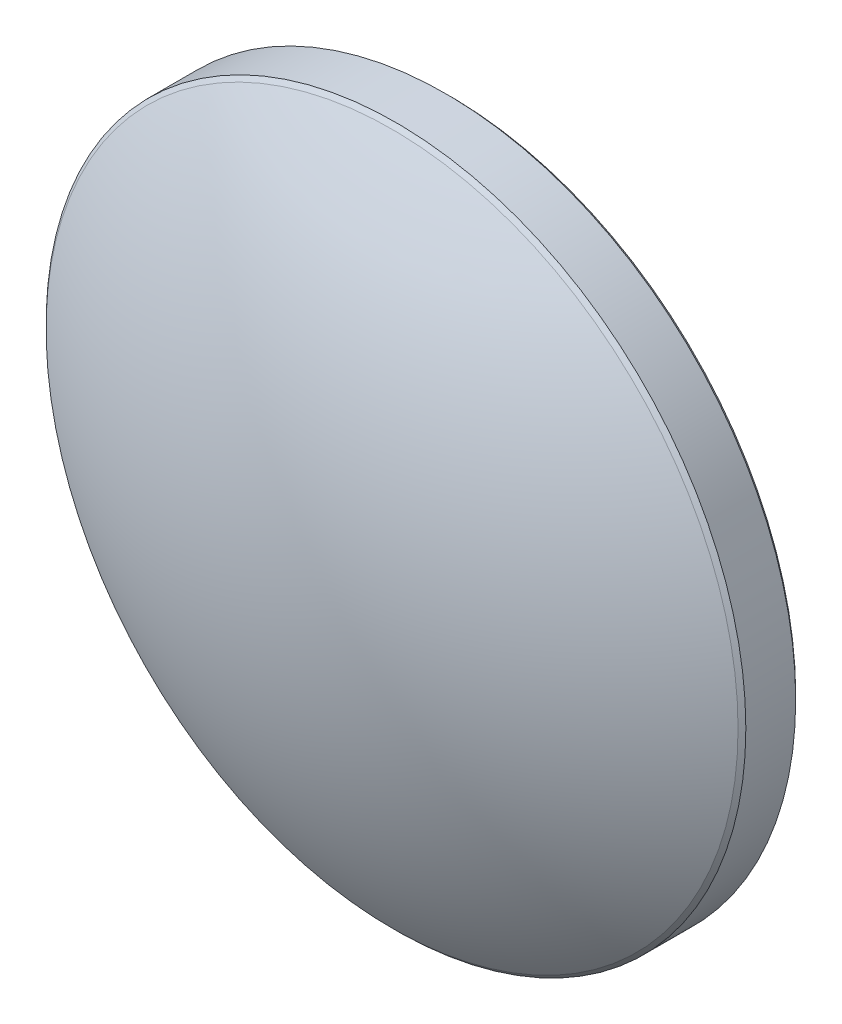
ISO-10303-21;
HEADER;
FILE_DESCRIPTION(('STEP AP214'),'2;1');
FILE_NAME('part.step','',(''),(''),'','','');
FILE_SCHEMA(('AUTOMOTIVE_DESIGN { 1 0 10303 214 1 1 1 1 }'));
ENDSEC;
DATA;
#1=APPLICATION_CONTEXT('core data for automotive mechanical design processes');
#2=APPLICATION_PROTOCOL_DEFINITION('international standard','automotive_design',2000,#1);
#3=PRODUCT_CONTEXT('',#1,'mechanical');
#4=PRODUCT('Part','Part','',(#3));
#5=PRODUCT_RELATED_PRODUCT_CATEGORY('part','',(#4));
#6=PRODUCT_DEFINITION_FORMATION('','',#4);
#7=PRODUCT_DEFINITION_CONTEXT('part definition',#1,'design');
#8=PRODUCT_DEFINITION('design','',#6,#7);
#9=PRODUCT_DEFINITION_SHAPE('','',#8);
#10=(LENGTH_UNIT() NAMED_UNIT(*) SI_UNIT(.MILLI.,.METRE.));
#11=(NAMED_UNIT(*) PLANE_ANGLE_UNIT() SI_UNIT($,.RADIAN.));
#12=(NAMED_UNIT(*) SI_UNIT($,.STERADIAN.) SOLID_ANGLE_UNIT());
#13=UNCERTAINTY_MEASURE_WITH_UNIT(LENGTH_MEASURE(1.E-05),#10,'distance_accuracy_value','');
#14=(GEOMETRIC_REPRESENTATION_CONTEXT(3) GLOBAL_UNCERTAINTY_ASSIGNED_CONTEXT((#13)) GLOBAL_UNIT_ASSIGNED_CONTEXT((#10,
#11,#12)) REPRESENTATION_CONTEXT('',''));
#15=CARTESIAN_POINT('',(0.,0.,0.));
#16=DIRECTION('',(0.,0.,1.));
#17=DIRECTION('',(1.,0.,0.));
#18=AXIS2_PLACEMENT_3D('',#15,#16,#17);
#19=CARTESIAN_POINT('',(0.00639396811435555,0.,-20.0899991112428));
#20=DIRECTION('',(0.,-1.,0.));
#21=DIRECTION('',(1.,0.,0.));
#22=AXIS2_PLACEMENT_3D('',#19,#20,#21);
#23=CIRCLE('',#22,23.);
#24=TRIMMED_CURVE('',#23,(PARAMETER_VALUE(-1.57107432541215)),
(PARAMETER_VALUE(1.57107432541215)),.T.,.PARAMETER.);
#25=CARTESIAN_POINT('',(0.,0.,-20.0899991112428));
#26=DIRECTION('',(0.,0.,1.));
#27=AXIS1_PLACEMENT('',#25,#26);
#28=SURFACE_OF_REVOLUTION('',#24,#27);
#29=CARTESIAN_POINT('',(0.,0.,2.91));
#30=VERTEX_POINT('',#29);
#31=VERTEX_LOOP('',#30);
#32=FACE_BOUND('',#31,.T.);
#33=CARTESIAN_POINT('',(0.,0.,-0.817151374895762));
#34=DIRECTION('',(0.,0.,1.));
#35=DIRECTION('',(1.,0.,0.));
#36=AXIS2_PLACEMENT_3D('',#33,#34,#35);
#37=CIRCLE('',#36,12.5585786437627);
#38=CARTESIAN_POINT('',(12.5585786437627,0.,-0.817151374895762));
#39=VERTEX_POINT('',#38);
#40=EDGE_CURVE('E29',#39,#39,#37,.T.);
#41=ORIENTED_EDGE('',*,*,#40,.T.);
#42=EDGE_LOOP('',(#41));
#43=FACE_BOUND('',#42,.T.);
#44=ADVANCED_FACE('F15',(#32,#43),#28,.T.);
#45=CARTESIAN_POINT('',(0.,0.,-2.91));
#46=DIRECTION('',(0.,0.,1.));
#47=DIRECTION('',(1.,0.,0.));
#48=AXIS2_PLACEMENT_3D('',#45,#46,#47);
#49=PLANE('',#48);
#50=CARTESIAN_POINT('',(0.,0.,-2.91));
#51=DIRECTION('',(0.,0.,1.));
#52=DIRECTION('',(1.,0.,0.));
#53=AXIS2_PLACEMENT_3D('',#50,#51,#52);
#54=CIRCLE('',#53,12.5585786437627);
#55=CARTESIAN_POINT('',(12.5585786437627,0.,-2.91));
#56=VERTEX_POINT('',#55);
#57=EDGE_CURVE('E10',#56,#56,#54,.T.);
#58=ORIENTED_EDGE('',*,*,#57,.F.);
#59=EDGE_LOOP('',(#58));
#60=FACE_BOUND('',#59,.T.);
#61=ADVANCED_FACE('F26',(#60),#49,.F.);
#62=CARTESIAN_POINT('',(0.,0.,-2.91));
#63=DIRECTION('',(0.,0.,1.));
#64=DIRECTION('',(1.,0.,0.));
#65=AXIS2_PLACEMENT_3D('',#62,#63,#64);
#66=CONICAL_SURFACE('',#65,12.5585786437627,0.785398163397436);
#67=CARTESIAN_POINT('',(0.,0.,-2.76857864376269));
#68=DIRECTION('',(0.,0.,1.));
#69=DIRECTION('',(1.,0.,0.));
#70=AXIS2_PLACEMENT_3D('',#67,#68,#69);
#71=CIRCLE('',#70,12.7);
#72=CARTESIAN_POINT('',(12.7,0.,-2.76857864376269));
#73=VERTEX_POINT('',#72);
#74=EDGE_CURVE('E21',#73,#73,#71,.T.);
#75=ORIENTED_EDGE('',*,*,#74,.F.);
#76=EDGE_LOOP('',(#75));
#77=FACE_BOUND('',#76,.T.);
#78=ORIENTED_EDGE('',*,*,#57,.T.);
#79=EDGE_LOOP('',(#78));
#80=FACE_BOUND('',#79,.T.);
#81=ADVANCED_FACE('F40',(#77,#80),#66,.T.);
#82=CARTESIAN_POINT('',(0.,0.,35.9400018251086));
#83=DIRECTION('',(0.,0.,1.));
#84=DIRECTION('',(1.,0.,0.));
#85=AXIS2_PLACEMENT_3D('',#82,#83,#84);
#86=CYLINDRICAL_SURFACE('',#85,12.7);
#87=CARTESIAN_POINT('',(0.,0.,-0.958572731133069));
#88=DIRECTION('',(0.,0.,1.));
#89=DIRECTION('',(1.,0.,0.));
#90=AXIS2_PLACEMENT_3D('',#87,#88,#89);
#91=CIRCLE('',#90,12.7);
#92=CARTESIAN_POINT('',(12.7,0.,-0.958572731133069));
#93=VERTEX_POINT('',#92);
#94=EDGE_CURVE('E31',#93,#93,#91,.T.);
#95=ORIENTED_EDGE('',*,*,#94,.F.);
#96=EDGE_LOOP('',(#95));
#97=FACE_BOUND('',#96,.T.);
#98=ORIENTED_EDGE('',*,*,#74,.T.);
#99=EDGE_LOOP('',(#98));
#100=FACE_BOUND('',#99,.T.);
#101=ADVANCED_FACE('F38',(#97,#100),#86,.T.);
#102=CARTESIAN_POINT('',(0.,0.,-0.958572731133069));
#103=DIRECTION('',(0.,0.,-1.));
#104=DIRECTION('',(-1.,0.,0.));
#105=AXIS2_PLACEMENT_3D('',#102,#103,#104);
#106=CONICAL_SURFACE('',#105,12.7,0.785398163397454);
#107=ORIENTED_EDGE('',*,*,#40,.F.);
#108=EDGE_LOOP('',(#107));
#109=FACE_BOUND('',#108,.T.);
#110=ORIENTED_EDGE('',*,*,#94,.T.);
#111=EDGE_LOOP('',(#110));
#112=FACE_BOUND('',#111,.T.);
#113=ADVANCED_FACE('F53',(#109,#112),#106,.T.);
#114=CLOSED_SHELL('',(#44,#61,#81,#101,#113));
#115=MANIFOLD_SOLID_BREP('B1',#114);
#116=ADVANCED_BREP_SHAPE_REPRESENTATION('',(#18,#115),#14);
#117=SHAPE_DEFINITION_REPRESENTATION(#9,#116);
ENDSEC;
END-ISO-10303-21;
